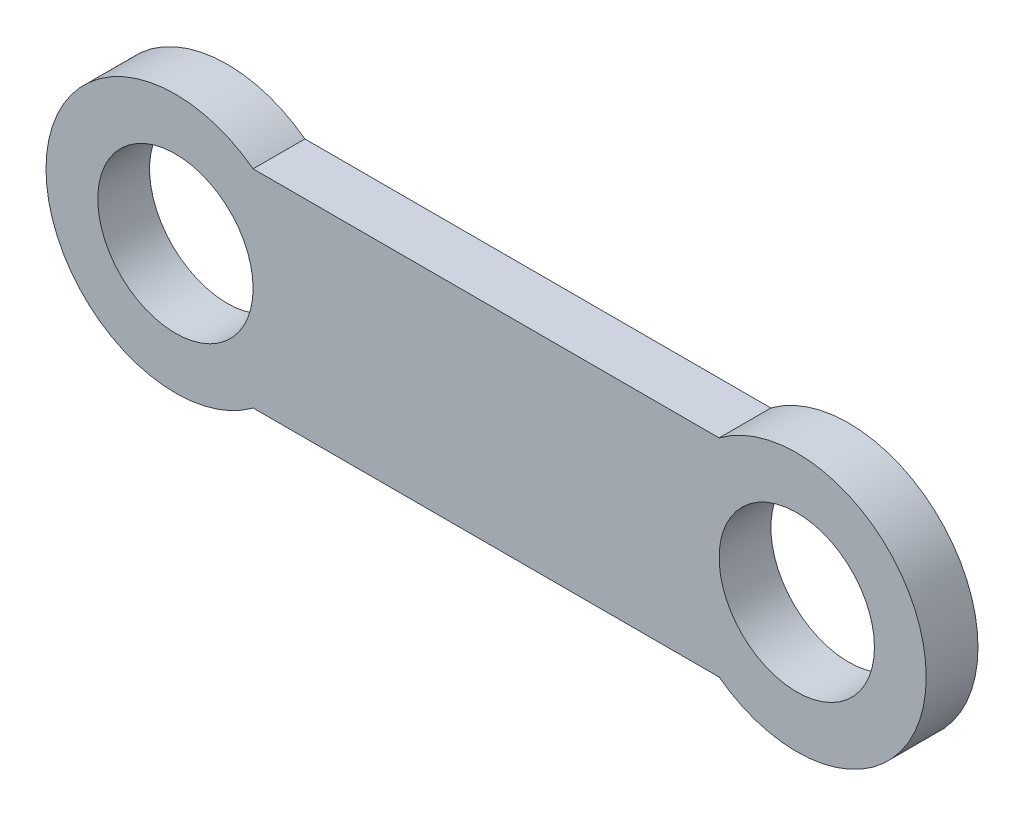
ISO-10303-21;
HEADER;
FILE_DESCRIPTION(('STEP AP214'),'2;1');
FILE_NAME('part.step','',(''),(''),'','','');
FILE_SCHEMA(('AUTOMOTIVE_DESIGN { 1 0 10303 214 1 1 1 1 }'));
ENDSEC;
DATA;
#1=APPLICATION_CONTEXT('core data for automotive mechanical design processes');
#2=APPLICATION_PROTOCOL_DEFINITION('international standard','automotive_design',2000,#1);
#3=PRODUCT_CONTEXT('',#1,'mechanical');
#4=PRODUCT('Part','Part','',(#3));
#5=PRODUCT_RELATED_PRODUCT_CATEGORY('part','',(#4));
#6=PRODUCT_DEFINITION_FORMATION('','',#4);
#7=PRODUCT_DEFINITION_CONTEXT('part definition',#1,'design');
#8=PRODUCT_DEFINITION('design','',#6,#7);
#9=PRODUCT_DEFINITION_SHAPE('','',#8);
#10=(LENGTH_UNIT() NAMED_UNIT(*) SI_UNIT(.MILLI.,.METRE.));
#11=(NAMED_UNIT(*) PLANE_ANGLE_UNIT() SI_UNIT($,.RADIAN.));
#12=(NAMED_UNIT(*) SI_UNIT($,.STERADIAN.) SOLID_ANGLE_UNIT());
#13=UNCERTAINTY_MEASURE_WITH_UNIT(LENGTH_MEASURE(1.E-05),#10,'distance_accuracy_value','');
#14=(GEOMETRIC_REPRESENTATION_CONTEXT(3) GLOBAL_UNCERTAINTY_ASSIGNED_CONTEXT((#13)) GLOBAL_UNIT_ASSIGNED_CONTEXT((#10,
#11,#12)) REPRESENTATION_CONTEXT('',''));
#15=CARTESIAN_POINT('',(0.,0.,0.));
#16=DIRECTION('',(0.,0.,1.));
#17=DIRECTION('',(1.,0.,0.));
#18=AXIS2_PLACEMENT_3D('',#15,#16,#17);
#19=CARTESIAN_POINT('',(6.,0.,1.));
#20=DIRECTION('',(0.,0.,1.));
#21=DIRECTION('',(1.,0.,0.));
#22=AXIS2_PLACEMENT_3D('',#19,#20,#21);
#23=PLANE('',#22);
#24=CARTESIAN_POINT('',(6.,0.,1.));
#25=DIRECTION('',(0.,0.,1.));
#26=DIRECTION('',(1.,0.,0.));
#27=AXIS2_PLACEMENT_3D('',#24,#25,#26);
#28=CIRCLE('',#27,1.5);
#29=CARTESIAN_POINT('',(7.5,0.,1.));
#30=VERTEX_POINT('',#29);
#31=EDGE_CURVE('E98',#30,#30,#28,.T.);
#32=ORIENTED_EDGE('',*,*,#31,.F.);
#33=EDGE_LOOP('',(#32));
#34=FACE_BOUND('',#33,.T.);
#35=CARTESIAN_POINT('',(6.,0.,1.));
#36=DIRECTION('',(0.,0.,1.));
#37=DIRECTION('',(1.,0.,0.));
#38=AXIS2_PLACEMENT_3D('',#35,#36,#37);
#39=CIRCLE('',#38,2.50000000000001);
#40=CARTESIAN_POINT('',(4.49999999999999,-2.,1.));
#41=VERTEX_POINT('',#40);
#42=CARTESIAN_POINT('',(4.49999999999999,2.,1.));
#43=VERTEX_POINT('',#42);
#44=EDGE_CURVE('E83',#41,#43,#39,.T.);
#45=ORIENTED_EDGE('',*,*,#44,.T.);
#46=DIRECTION('',(-1.,0.,0.));
#47=VECTOR('',#46,1.);
#48=CARTESIAN_POINT('',(-4.5,2.,1.));
#49=LINE('',#48,#47);
#50=CARTESIAN_POINT('',(-4.5,2.,1.));
#51=VERTEX_POINT('',#50);
#52=EDGE_CURVE('E78',#43,#51,#49,.T.);
#53=ORIENTED_EDGE('',*,*,#52,.T.);
#54=CARTESIAN_POINT('',(-6.00000000000001,0.,1.));
#55=DIRECTION('',(0.,0.,1.));
#56=DIRECTION('',(1.,0.,0.));
#57=AXIS2_PLACEMENT_3D('',#54,#55,#56);
#58=CIRCLE('',#57,2.5);
#59=CARTESIAN_POINT('',(-4.5,-2.,1.));
#60=VERTEX_POINT('',#59);
#61=EDGE_CURVE('E81',#51,#60,#58,.T.);
#62=ORIENTED_EDGE('',*,*,#61,.T.);
#63=DIRECTION('',(1.,0.,0.));
#64=VECTOR('',#63,1.);
#65=CARTESIAN_POINT('',(-4.5,-2.,1.));
#66=LINE('',#65,#64);
#67=EDGE_CURVE('E48',#60,#41,#66,.T.);
#68=ORIENTED_EDGE('',*,*,#67,.T.);
#69=EDGE_LOOP('',(#45,#53,#62,#68));
#70=FACE_BOUND('',#69,.T.);
#71=CARTESIAN_POINT('',(-6.00000000000001,0.,1.));
#72=DIRECTION('',(0.,0.,1.));
#73=DIRECTION('',(1.,0.,0.));
#74=AXIS2_PLACEMENT_3D('',#71,#72,#73);
#75=CIRCLE('',#74,1.5);
#76=CARTESIAN_POINT('',(-4.50000000000001,0.,1.));
#77=VERTEX_POINT('',#76);
#78=EDGE_CURVE('E113',#77,#77,#75,.T.);
#79=ORIENTED_EDGE('',*,*,#78,.F.);
#80=EDGE_LOOP('',(#79));
#81=FACE_BOUND('',#80,.T.);
#82=ADVANCED_FACE('F31',(#34,#70,#81),#23,.T.);
#83=CARTESIAN_POINT('',(6.,0.,0.));
#84=DIRECTION('',(0.,0.,1.));
#85=DIRECTION('',(1.,0.,0.));
#86=AXIS2_PLACEMENT_3D('',#83,#84,#85);
#87=PLANE('',#86);
#88=CARTESIAN_POINT('',(6.,0.,0.));
#89=DIRECTION('',(0.,0.,1.));
#90=DIRECTION('',(1.,0.,0.));
#91=AXIS2_PLACEMENT_3D('',#88,#89,#90);
#92=CIRCLE('',#91,1.5);
#93=CARTESIAN_POINT('',(7.5,0.,0.));
#94=VERTEX_POINT('',#93);
#95=EDGE_CURVE('E110',#94,#94,#92,.T.);
#96=ORIENTED_EDGE('',*,*,#95,.T.);
#97=EDGE_LOOP('',(#96));
#98=FACE_BOUND('',#97,.T.);
#99=CARTESIAN_POINT('',(6.,0.,0.));
#100=DIRECTION('',(0.,0.,1.));
#101=DIRECTION('',(1.,0.,0.));
#102=AXIS2_PLACEMENT_3D('',#99,#100,#101);
#103=CIRCLE('',#102,2.50000000000001);
#104=CARTESIAN_POINT('',(4.49999999999999,-2.,0.));
#105=VERTEX_POINT('',#104);
#106=CARTESIAN_POINT('',(4.49999999999999,2.,0.));
#107=VERTEX_POINT('',#106);
#108=EDGE_CURVE('E95',#105,#107,#103,.T.);
#109=ORIENTED_EDGE('',*,*,#108,.F.);
#110=DIRECTION('',(1.,0.,0.));
#111=VECTOR('',#110,1.);
#112=CARTESIAN_POINT('',(-4.5,-2.,0.));
#113=LINE('',#112,#111);
#114=CARTESIAN_POINT('',(-4.5,-2.,0.));
#115=VERTEX_POINT('',#114);
#116=EDGE_CURVE('E71',#115,#105,#113,.T.);
#117=ORIENTED_EDGE('',*,*,#116,.F.);
#118=CARTESIAN_POINT('',(-6.00000000000001,0.,0.));
#119=DIRECTION('',(0.,0.,1.));
#120=DIRECTION('',(1.,0.,0.));
#121=AXIS2_PLACEMENT_3D('',#118,#119,#120);
#122=CIRCLE('',#121,2.5);
#123=CARTESIAN_POINT('',(-4.5,2.,0.));
#124=VERTEX_POINT('',#123);
#125=EDGE_CURVE('E65',#124,#115,#122,.T.);
#126=ORIENTED_EDGE('',*,*,#125,.F.);
#127=DIRECTION('',(-1.,0.,0.));
#128=VECTOR('',#127,1.);
#129=CARTESIAN_POINT('',(-4.5,2.,0.));
#130=LINE('',#129,#128);
#131=EDGE_CURVE('E87',#107,#124,#130,.T.);
#132=ORIENTED_EDGE('',*,*,#131,.F.);
#133=EDGE_LOOP('',(#109,#117,#126,#132));
#134=FACE_BOUND('',#133,.T.);
#135=CARTESIAN_POINT('',(-6.00000000000001,0.,0.));
#136=DIRECTION('',(0.,0.,1.));
#137=DIRECTION('',(1.,0.,0.));
#138=AXIS2_PLACEMENT_3D('',#135,#136,#137);
#139=CIRCLE('',#138,1.5);
#140=CARTESIAN_POINT('',(-4.50000000000001,0.,0.));
#141=VERTEX_POINT('',#140);
#142=EDGE_CURVE('E116',#141,#141,#139,.T.);
#143=ORIENTED_EDGE('',*,*,#142,.T.);
#144=EDGE_LOOP('',(#143));
#145=FACE_BOUND('',#144,.T.);
#146=ADVANCED_FACE('F106',(#98,#134,#145),#87,.F.);
#147=CARTESIAN_POINT('',(6.,0.,1.));
#148=DIRECTION('',(0.,0.,-1.));
#149=DIRECTION('',(-1.,0.,0.));
#150=AXIS2_PLACEMENT_3D('',#147,#148,#149);
#151=CYLINDRICAL_SURFACE('',#150,2.50000000000001);
#152=ORIENTED_EDGE('',*,*,#108,.T.);
#153=DIRECTION('',(0.,0.,-1.));
#154=VECTOR('',#153,1.);
#155=CARTESIAN_POINT('',(4.49999999999999,2.,1.));
#156=LINE('',#155,#154);
#157=EDGE_CURVE('E11',#43,#107,#156,.T.);
#158=ORIENTED_EDGE('',*,*,#157,.F.);
#159=ORIENTED_EDGE('',*,*,#44,.F.);
#160=DIRECTION('',(0.,0.,-1.));
#161=VECTOR('',#160,1.);
#162=CARTESIAN_POINT('',(4.49999999999999,-2.,1.));
#163=LINE('',#162,#161);
#164=EDGE_CURVE('E91',#41,#105,#163,.T.);
#165=ORIENTED_EDGE('',*,*,#164,.T.);
#166=EDGE_LOOP('',(#152,#158,#159,#165));
#167=FACE_BOUND('',#166,.T.);
#168=ADVANCED_FACE('F33',(#167),#151,.T.);
#169=CARTESIAN_POINT('',(-4.5,2.,1.));
#170=DIRECTION('',(0.,-1.,0.));
#171=DIRECTION('',(0.,0.,-1.));
#172=AXIS2_PLACEMENT_3D('',#169,#170,#171);
#173=PLANE('',#172);
#174=ORIENTED_EDGE('',*,*,#131,.T.);
#175=DIRECTION('',(0.,0.,-1.));
#176=VECTOR('',#175,1.);
#177=CARTESIAN_POINT('',(-4.5,2.,1.));
#178=LINE('',#177,#176);
#179=EDGE_CURVE('E40',#51,#124,#178,.T.);
#180=ORIENTED_EDGE('',*,*,#179,.F.);
#181=ORIENTED_EDGE('',*,*,#52,.F.);
#182=ORIENTED_EDGE('',*,*,#157,.T.);
#183=EDGE_LOOP('',(#174,#180,#181,#182));
#184=FACE_BOUND('',#183,.T.);
#185=ADVANCED_FACE('F86',(#184),#173,.F.);
#186=CARTESIAN_POINT('',(-6.00000000000001,0.,1.));
#187=DIRECTION('',(0.,0.,-1.));
#188=DIRECTION('',(-1.,0.,0.));
#189=AXIS2_PLACEMENT_3D('',#186,#187,#188);
#190=CYLINDRICAL_SURFACE('',#189,2.5);
#191=ORIENTED_EDGE('',*,*,#125,.T.);
#192=DIRECTION('',(0.,0.,-1.));
#193=VECTOR('',#192,1.);
#194=CARTESIAN_POINT('',(-4.5,-2.,1.));
#195=LINE('',#194,#193);
#196=EDGE_CURVE('E88',#60,#115,#195,.T.);
#197=ORIENTED_EDGE('',*,*,#196,.F.);
#198=ORIENTED_EDGE('',*,*,#61,.F.);
#199=ORIENTED_EDGE('',*,*,#179,.T.);
#200=EDGE_LOOP('',(#191,#197,#198,#199));
#201=FACE_BOUND('',#200,.T.);
#202=ADVANCED_FACE('F89',(#201),#190,.T.);
#203=CARTESIAN_POINT('',(-4.5,-2.,1.));
#204=DIRECTION('',(0.,1.,0.));
#205=DIRECTION('',(0.,0.,1.));
#206=AXIS2_PLACEMENT_3D('',#203,#204,#205);
#207=PLANE('',#206);
#208=ORIENTED_EDGE('',*,*,#116,.T.);
#209=ORIENTED_EDGE('',*,*,#164,.F.);
#210=ORIENTED_EDGE('',*,*,#67,.F.);
#211=ORIENTED_EDGE('',*,*,#196,.T.);
#212=EDGE_LOOP('',(#208,#209,#210,#211));
#213=FACE_BOUND('',#212,.T.);
#214=ADVANCED_FACE('F103',(#213),#207,.F.);
#215=CARTESIAN_POINT('',(6.,0.,1.));
#216=DIRECTION('',(0.,0.,-1.));
#217=DIRECTION('',(-1.,0.,0.));
#218=AXIS2_PLACEMENT_3D('',#215,#216,#217);
#219=CYLINDRICAL_SURFACE('',#218,1.5);
#220=ORIENTED_EDGE('',*,*,#31,.T.);
#221=EDGE_LOOP('',(#220));
#222=FACE_BOUND('',#221,.T.);
#223=ORIENTED_EDGE('',*,*,#95,.F.);
#224=EDGE_LOOP('',(#223));
#225=FACE_BOUND('',#224,.T.);
#226=ADVANCED_FACE('F134',(#222,#225),#219,.F.);
#227=CARTESIAN_POINT('',(-6.00000000000001,0.,1.));
#228=DIRECTION('',(0.,0.,-1.));
#229=DIRECTION('',(-1.,0.,0.));
#230=AXIS2_PLACEMENT_3D('',#227,#228,#229);
#231=CYLINDRICAL_SURFACE('',#230,1.5);
#232=ORIENTED_EDGE('',*,*,#78,.T.);
#233=EDGE_LOOP('',(#232));
#234=FACE_BOUND('',#233,.T.);
#235=ORIENTED_EDGE('',*,*,#142,.F.);
#236=EDGE_LOOP('',(#235));
#237=FACE_BOUND('',#236,.T.);
#238=ADVANCED_FACE('F122',(#234,#237),#231,.F.);
#239=CLOSED_SHELL('',(#82,#146,#168,#185,#202,#214,#226,#238));
#240=MANIFOLD_SOLID_BREP('B2',#239);
#241=ADVANCED_BREP_SHAPE_REPRESENTATION('',(#18,#240),#14);
#242=SHAPE_DEFINITION_REPRESENTATION(#9,#241);
ENDSEC;
END-ISO-10303-21;
